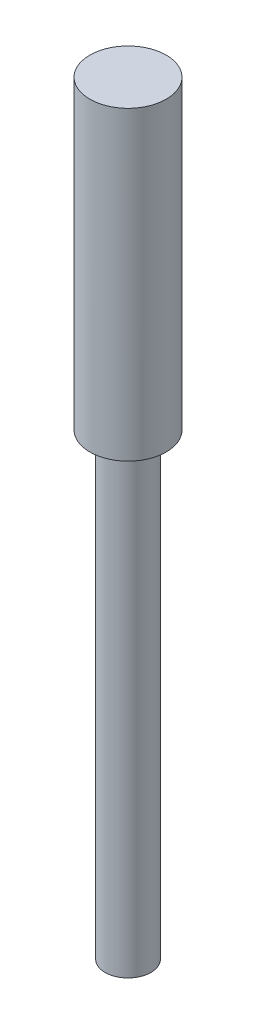
ISO-10303-21;
HEADER;
FILE_DESCRIPTION(('STEP AP214'),'2;1');
FILE_NAME('part.step','',(''),(''),'','','');
FILE_SCHEMA(('AUTOMOTIVE_DESIGN { 1 0 10303 214 1 1 1 1 }'));
ENDSEC;
DATA;
#1=APPLICATION_CONTEXT('core data for automotive mechanical design processes');
#2=APPLICATION_PROTOCOL_DEFINITION('international standard','automotive_design',2000,#1);
#3=PRODUCT_CONTEXT('',#1,'mechanical');
#4=PRODUCT('Part','Part','',(#3));
#5=PRODUCT_RELATED_PRODUCT_CATEGORY('part','',(#4));
#6=PRODUCT_DEFINITION_FORMATION('','',#4);
#7=PRODUCT_DEFINITION_CONTEXT('part definition',#1,'design');
#8=PRODUCT_DEFINITION('design','',#6,#7);
#9=PRODUCT_DEFINITION_SHAPE('','',#8);
#10=(LENGTH_UNIT() NAMED_UNIT(*) SI_UNIT(.MILLI.,.METRE.));
#11=(NAMED_UNIT(*) PLANE_ANGLE_UNIT() SI_UNIT($,.RADIAN.));
#12=(NAMED_UNIT(*) SI_UNIT($,.STERADIAN.) SOLID_ANGLE_UNIT());
#13=UNCERTAINTY_MEASURE_WITH_UNIT(LENGTH_MEASURE(1.E-05),#10,'distance_accuracy_value','');
#14=(GEOMETRIC_REPRESENTATION_CONTEXT(3) GLOBAL_UNCERTAINTY_ASSIGNED_CONTEXT((#13)) GLOBAL_UNIT_ASSIGNED_CONTEXT((#10,
#11,#12)) REPRESENTATION_CONTEXT('',''));
#15=CARTESIAN_POINT('',(0.,0.,0.));
#16=DIRECTION('',(0.,0.,1.));
#17=DIRECTION('',(1.,0.,0.));
#18=AXIS2_PLACEMENT_3D('',#15,#16,#17);
#19=CARTESIAN_POINT('',(0.,100.,0.));
#20=DIRECTION('',(0.,-1.,0.));
#21=DIRECTION('',(0.,0.,-1.));
#22=AXIS2_PLACEMENT_3D('',#19,#20,#21);
#23=CYLINDRICAL_SURFACE('',#22,5.);
#24=CARTESIAN_POINT('',(0.,100.,0.));
#25=DIRECTION('',(0.,1.,0.));
#26=DIRECTION('',(0.,0.,1.));
#27=AXIS2_PLACEMENT_3D('',#24,#25,#26);
#28=CIRCLE('',#27,5.);
#29=CARTESIAN_POINT('',(0.,100.,5.));
#30=VERTEX_POINT('',#29);
#31=EDGE_CURVE('E10',#30,#30,#28,.T.);
#32=ORIENTED_EDGE('',*,*,#31,.F.);
#33=EDGE_LOOP('',(#32));
#34=FACE_BOUND('',#33,.T.);
#35=CARTESIAN_POINT('',(0.,60.,0.));
#36=DIRECTION('',(0.,-1.,0.));
#37=DIRECTION('',(0.,0.,-1.));
#38=AXIS2_PLACEMENT_3D('',#35,#36,#37);
#39=CIRCLE('',#38,5.);
#40=CARTESIAN_POINT('',(0.,60.,-5.));
#41=VERTEX_POINT('',#40);
#42=EDGE_CURVE('E36',#41,#41,#39,.T.);
#43=ORIENTED_EDGE('',*,*,#42,.F.);
#44=EDGE_LOOP('',(#43));
#45=FACE_BOUND('',#44,.T.);
#46=ADVANCED_FACE('F30',(#34,#45),#23,.T.);
#47=CARTESIAN_POINT('',(0.,100.,0.));
#48=DIRECTION('',(0.,1.,0.));
#49=DIRECTION('',(0.,0.,1.));
#50=AXIS2_PLACEMENT_3D('',#47,#48,#49);
#51=PLANE('',#50);
#52=ORIENTED_EDGE('',*,*,#31,.T.);
#53=EDGE_LOOP('',(#52));
#54=FACE_BOUND('',#53,.T.);
#55=ADVANCED_FACE('F61',(#54),#51,.T.);
#56=CARTESIAN_POINT('',(0.,60.,0.));
#57=DIRECTION('',(0.,-1.,0.));
#58=DIRECTION('',(0.,0.,-1.));
#59=AXIS2_PLACEMENT_3D('',#56,#57,#58);
#60=PLANE('',#59);
#61=CARTESIAN_POINT('',(0.,60.,0.));
#62=DIRECTION('',(0.,-1.,0.));
#63=DIRECTION('',(0.,0.,-1.));
#64=AXIS2_PLACEMENT_3D('',#61,#62,#63);
#65=CIRCLE('',#64,3.);
#66=CARTESIAN_POINT('',(0.,60.,-3.));
#67=VERTEX_POINT('',#66);
#68=EDGE_CURVE('E40',#67,#67,#65,.T.);
#69=ORIENTED_EDGE('',*,*,#68,.F.);
#70=EDGE_LOOP('',(#69));
#71=FACE_BOUND('',#70,.T.);
#72=ORIENTED_EDGE('',*,*,#42,.T.);
#73=EDGE_LOOP('',(#72));
#74=FACE_BOUND('',#73,.T.);
#75=ADVANCED_FACE('F54',(#71,#74),#60,.T.);
#76=CARTESIAN_POINT('',(0.,60.,0.));
#77=DIRECTION('',(0.,-1.,0.));
#78=DIRECTION('',(0.,0.,-1.));
#79=AXIS2_PLACEMENT_3D('',#76,#77,#78);
#80=CYLINDRICAL_SURFACE('',#79,3.);
#81=ORIENTED_EDGE('',*,*,#68,.T.);
#82=EDGE_LOOP('',(#81));
#83=FACE_BOUND('',#82,.T.);
#84=CARTESIAN_POINT('',(0.,0.,0.));
#85=DIRECTION('',(0.,-1.,0.));
#86=DIRECTION('',(0.,0.,-1.));
#87=AXIS2_PLACEMENT_3D('',#84,#85,#86);
#88=CIRCLE('',#87,3.);
#89=CARTESIAN_POINT('',(0.,0.,-3.));
#90=VERTEX_POINT('',#89);
#91=EDGE_CURVE('E44',#90,#90,#88,.T.);
#92=ORIENTED_EDGE('',*,*,#91,.F.);
#93=EDGE_LOOP('',(#92));
#94=FACE_BOUND('',#93,.T.);
#95=ADVANCED_FACE('F52',(#83,#94),#80,.T.);
#96=CARTESIAN_POINT('',(0.,0.,0.));
#97=DIRECTION('',(0.,1.,0.));
#98=DIRECTION('',(0.,0.,1.));
#99=AXIS2_PLACEMENT_3D('',#96,#97,#98);
#100=PLANE('',#99);
#101=ORIENTED_EDGE('',*,*,#91,.T.);
#102=EDGE_LOOP('',(#101));
#103=FACE_BOUND('',#102,.T.);
#104=ADVANCED_FACE('F50',(#103),#100,.F.);
#105=CLOSED_SHELL('',(#46,#55,#75,#95,#104));
#106=MANIFOLD_SOLID_BREP('B2',#105);
#107=ADVANCED_BREP_SHAPE_REPRESENTATION('',(#18,#106),#14);
#108=SHAPE_DEFINITION_REPRESENTATION(#9,#107);
ENDSEC;
END-ISO-10303-21;
